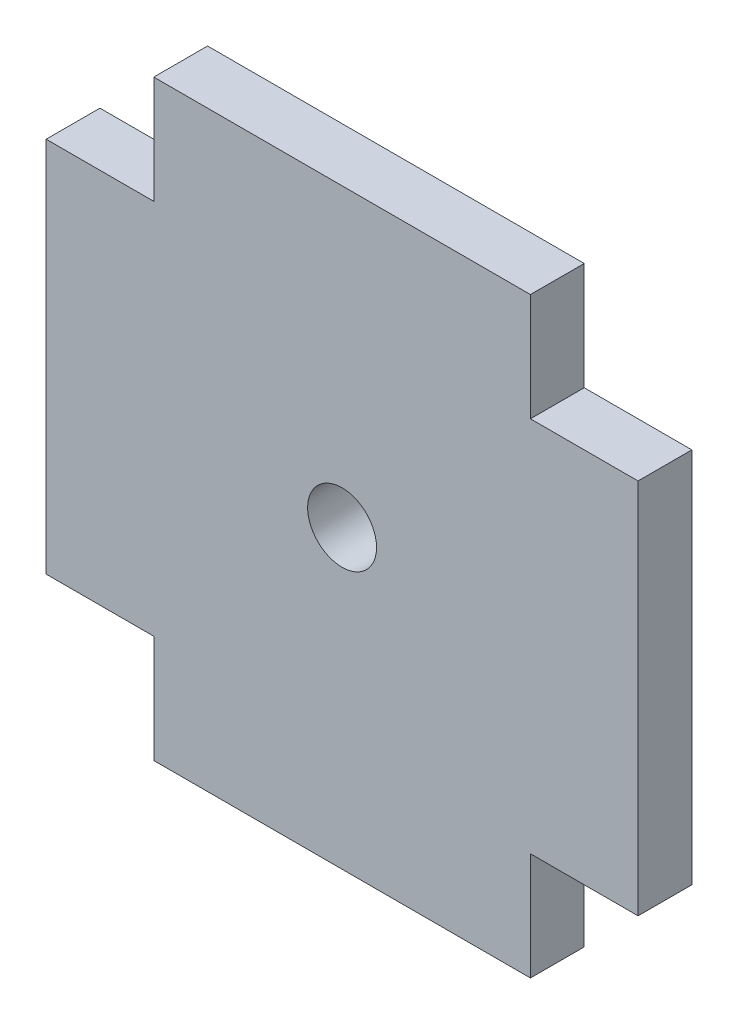
ISO-10303-21;
HEADER;
FILE_DESCRIPTION(('STEP AP214'),'2;1');
FILE_NAME('part.step','',(''),(''),'','','');
FILE_SCHEMA(('AUTOMOTIVE_DESIGN { 1 0 10303 214 1 1 1 1 }'));
ENDSEC;
DATA;
#1=APPLICATION_CONTEXT('core data for automotive mechanical design processes');
#2=APPLICATION_PROTOCOL_DEFINITION('international standard','automotive_design',2000,#1);
#3=PRODUCT_CONTEXT('',#1,'mechanical');
#4=PRODUCT('Part','Part','',(#3));
#5=PRODUCT_RELATED_PRODUCT_CATEGORY('part','',(#4));
#6=PRODUCT_DEFINITION_FORMATION('','',#4);
#7=PRODUCT_DEFINITION_CONTEXT('part definition',#1,'design');
#8=PRODUCT_DEFINITION('design','',#6,#7);
#9=PRODUCT_DEFINITION_SHAPE('','',#8);
#10=(LENGTH_UNIT() NAMED_UNIT(*) SI_UNIT(.MILLI.,.METRE.));
#11=(NAMED_UNIT(*) PLANE_ANGLE_UNIT() SI_UNIT($,.RADIAN.));
#12=(NAMED_UNIT(*) SI_UNIT($,.STERADIAN.) SOLID_ANGLE_UNIT());
#13=UNCERTAINTY_MEASURE_WITH_UNIT(LENGTH_MEASURE(1.E-05),#10,'distance_accuracy_value','');
#14=(GEOMETRIC_REPRESENTATION_CONTEXT(3) GLOBAL_UNCERTAINTY_ASSIGNED_CONTEXT((#13)) GLOBAL_UNIT_ASSIGNED_CONTEXT((#10,
#11,#12)) REPRESENTATION_CONTEXT('',''));
#15=CARTESIAN_POINT('',(0.,0.,0.));
#16=DIRECTION('',(0.,0.,1.));
#17=DIRECTION('',(1.,0.,0.));
#18=AXIS2_PLACEMENT_3D('',#15,#16,#17);
#19=CARTESIAN_POINT('',(-17.5,17.5,-5.));
#20=DIRECTION('',(-1.,0.,0.));
#21=DIRECTION('',(0.,0.,1.));
#22=AXIS2_PLACEMENT_3D('',#19,#20,#21);
#23=PLANE('',#22);
#24=DIRECTION('',(0.,-1.,0.));
#25=VECTOR('',#24,1.);
#26=CARTESIAN_POINT('',(-17.5,17.5,0.));
#27=LINE('',#26,#25);
#28=CARTESIAN_POINT('',(-17.5,27.5,0.));
#29=VERTEX_POINT('',#28);
#30=CARTESIAN_POINT('',(-17.5,17.5,0.));
#31=VERTEX_POINT('',#30);
#32=EDGE_CURVE('E154',#29,#31,#27,.T.);
#33=ORIENTED_EDGE('',*,*,#32,.F.);
#34=DIRECTION('',(0.,0.,1.));
#35=VECTOR('',#34,1.);
#36=CARTESIAN_POINT('',(-17.5,27.5,-5.));
#37=LINE('',#36,#35);
#38=CARTESIAN_POINT('',(-17.5,27.5,-5.));
#39=VERTEX_POINT('',#38);
#40=EDGE_CURVE('E11',#39,#29,#37,.T.);
#41=ORIENTED_EDGE('',*,*,#40,.F.);
#42=DIRECTION('',(0.,-1.,0.));
#43=VECTOR('',#42,1.);
#44=CARTESIAN_POINT('',(-17.5,17.5,-5.));
#45=LINE('',#44,#43);
#46=CARTESIAN_POINT('',(-17.5,17.5,-5.));
#47=VERTEX_POINT('',#46);
#48=EDGE_CURVE('E187',#39,#47,#45,.T.);
#49=ORIENTED_EDGE('',*,*,#48,.T.);
#50=DIRECTION('',(0.,0.,1.));
#51=VECTOR('',#50,1.);
#52=CARTESIAN_POINT('',(-17.5,17.5,-5.));
#53=LINE('',#52,#51);
#54=EDGE_CURVE('E36',#47,#31,#53,.T.);
#55=ORIENTED_EDGE('',*,*,#54,.T.);
#56=EDGE_LOOP('',(#33,#41,#49,#55));
#57=FACE_BOUND('',#56,.T.);
#58=ADVANCED_FACE('F33',(#57),#23,.T.);
#59=CARTESIAN_POINT('',(-17.5,27.5,-5.));
#60=DIRECTION('',(0.,1.,0.));
#61=DIRECTION('',(0.,0.,1.));
#62=AXIS2_PLACEMENT_3D('',#59,#60,#61);
#63=PLANE('',#62);
#64=DIRECTION('',(-1.,0.,0.));
#65=VECTOR('',#64,1.);
#66=CARTESIAN_POINT('',(-17.5,27.5,0.));
#67=LINE('',#66,#65);
#68=CARTESIAN_POINT('',(17.5,27.5,0.));
#69=VERTEX_POINT('',#68);
#70=EDGE_CURVE('E185',#69,#29,#67,.T.);
#71=ORIENTED_EDGE('',*,*,#70,.F.);
#72=DIRECTION('',(0.,0.,1.));
#73=VECTOR('',#72,1.);
#74=CARTESIAN_POINT('',(17.5,27.5,-5.));
#75=LINE('',#74,#73);
#76=CARTESIAN_POINT('',(17.5,27.5,-5.));
#77=VERTEX_POINT('',#76);
#78=EDGE_CURVE('E42',#77,#69,#75,.T.);
#79=ORIENTED_EDGE('',*,*,#78,.F.);
#80=DIRECTION('',(-1.,0.,0.));
#81=VECTOR('',#80,1.);
#82=CARTESIAN_POINT('',(-17.5,27.5,-5.));
#83=LINE('',#82,#81);
#84=EDGE_CURVE('E144',#77,#39,#83,.T.);
#85=ORIENTED_EDGE('',*,*,#84,.T.);
#86=ORIENTED_EDGE('',*,*,#40,.T.);
#87=EDGE_LOOP('',(#71,#79,#85,#86));
#88=FACE_BOUND('',#87,.T.);
#89=ADVANCED_FACE('F207',(#88),#63,.T.);
#90=CARTESIAN_POINT('',(17.5,27.5,-5.));
#91=DIRECTION('',(1.,0.,0.));
#92=DIRECTION('',(0.,0.,-1.));
#93=AXIS2_PLACEMENT_3D('',#90,#91,#92);
#94=PLANE('',#93);
#95=DIRECTION('',(0.,1.,0.));
#96=VECTOR('',#95,1.);
#97=CARTESIAN_POINT('',(17.5,27.5,0.));
#98=LINE('',#97,#96);
#99=CARTESIAN_POINT('',(17.5,17.5,0.));
#100=VERTEX_POINT('',#99);
#101=EDGE_CURVE('E131',#100,#69,#98,.T.);
#102=ORIENTED_EDGE('',*,*,#101,.F.);
#103=DIRECTION('',(0.,0.,1.));
#104=VECTOR('',#103,1.);
#105=CARTESIAN_POINT('',(17.5,17.5,-5.));
#106=LINE('',#105,#104);
#107=CARTESIAN_POINT('',(17.5,17.5,-5.));
#108=VERTEX_POINT('',#107);
#109=EDGE_CURVE('E126',#108,#100,#106,.T.);
#110=ORIENTED_EDGE('',*,*,#109,.F.);
#111=DIRECTION('',(0.,1.,0.));
#112=VECTOR('',#111,1.);
#113=CARTESIAN_POINT('',(17.5,27.5,-5.));
#114=LINE('',#113,#112);
#115=EDGE_CURVE('E129',#108,#77,#114,.T.);
#116=ORIENTED_EDGE('',*,*,#115,.T.);
#117=ORIENTED_EDGE('',*,*,#78,.T.);
#118=EDGE_LOOP('',(#102,#110,#116,#117));
#119=FACE_BOUND('',#118,.T.);
#120=ADVANCED_FACE('F128',(#119),#94,.T.);
#121=CARTESIAN_POINT('',(17.5,17.5,-5.));
#122=DIRECTION('',(0.,1.,0.));
#123=DIRECTION('',(0.,0.,1.));
#124=AXIS2_PLACEMENT_3D('',#121,#122,#123);
#125=PLANE('',#124);
#126=DIRECTION('',(-1.,0.,0.));
#127=VECTOR('',#126,1.);
#128=CARTESIAN_POINT('',(17.5,17.5,0.));
#129=LINE('',#128,#127);
#130=CARTESIAN_POINT('',(27.5,17.5,0.));
#131=VERTEX_POINT('',#130);
#132=EDGE_CURVE('E182',#131,#100,#129,.T.);
#133=ORIENTED_EDGE('',*,*,#132,.F.);
#134=DIRECTION('',(0.,0.,1.));
#135=VECTOR('',#134,1.);
#136=CARTESIAN_POINT('',(27.5,17.5,-5.));
#137=LINE('',#136,#135);
#138=CARTESIAN_POINT('',(27.5,17.5,-5.));
#139=VERTEX_POINT('',#138);
#140=EDGE_CURVE('E136',#139,#131,#137,.T.);
#141=ORIENTED_EDGE('',*,*,#140,.F.);
#142=DIRECTION('',(-1.,0.,0.));
#143=VECTOR('',#142,1.);
#144=CARTESIAN_POINT('',(17.5,17.5,-5.));
#145=LINE('',#144,#143);
#146=EDGE_CURVE('E142',#139,#108,#145,.T.);
#147=ORIENTED_EDGE('',*,*,#146,.T.);
#148=ORIENTED_EDGE('',*,*,#109,.T.);
#149=EDGE_LOOP('',(#133,#141,#147,#148));
#150=FACE_BOUND('',#149,.T.);
#151=ADVANCED_FACE('F146',(#150),#125,.T.);
#152=CARTESIAN_POINT('',(27.5,17.5,-5.));
#153=DIRECTION('',(1.,0.,0.));
#154=DIRECTION('',(0.,1.,0.));
#155=AXIS2_PLACEMENT_3D('',#152,#153,#154);
#156=PLANE('',#155);
#157=DIRECTION('',(0.,1.,0.));
#158=VECTOR('',#157,1.);
#159=CARTESIAN_POINT('',(27.5,17.5,0.));
#160=LINE('',#159,#158);
#161=CARTESIAN_POINT('',(27.5,-17.5,0.));
#162=VERTEX_POINT('',#161);
#163=EDGE_CURVE('E179',#162,#131,#160,.T.);
#164=ORIENTED_EDGE('',*,*,#163,.F.);
#165=DIRECTION('',(0.,0.,1.));
#166=VECTOR('',#165,1.);
#167=CARTESIAN_POINT('',(27.5,-17.5,-5.));
#168=LINE('',#167,#166);
#169=CARTESIAN_POINT('',(27.5,-17.5,-5.));
#170=VERTEX_POINT('',#169);
#171=EDGE_CURVE('E191',#170,#162,#168,.T.);
#172=ORIENTED_EDGE('',*,*,#171,.F.);
#173=DIRECTION('',(0.,1.,0.));
#174=VECTOR('',#173,1.);
#175=CARTESIAN_POINT('',(27.5,17.5,-5.));
#176=LINE('',#175,#174);
#177=EDGE_CURVE('E147',#170,#139,#176,.T.);
#178=ORIENTED_EDGE('',*,*,#177,.T.);
#179=ORIENTED_EDGE('',*,*,#140,.T.);
#180=EDGE_LOOP('',(#164,#172,#178,#179));
#181=FACE_BOUND('',#180,.T.);
#182=ADVANCED_FACE('F220',(#181),#156,.T.);
#183=CARTESIAN_POINT('',(27.5,-17.5,-5.));
#184=DIRECTION('',(0.,-1.,0.));
#185=DIRECTION('',(0.,0.,-1.));
#186=AXIS2_PLACEMENT_3D('',#183,#184,#185);
#187=PLANE('',#186);
#188=DIRECTION('',(1.,0.,0.));
#189=VECTOR('',#188,1.);
#190=CARTESIAN_POINT('',(27.5,-17.5,0.));
#191=LINE('',#190,#189);
#192=CARTESIAN_POINT('',(17.5,-17.5,0.));
#193=VERTEX_POINT('',#192);
#194=EDGE_CURVE('E176',#193,#162,#191,.T.);
#195=ORIENTED_EDGE('',*,*,#194,.F.);
#196=DIRECTION('',(0.,0.,1.));
#197=VECTOR('',#196,1.);
#198=CARTESIAN_POINT('',(17.5,-17.5,-5.));
#199=LINE('',#198,#197);
#200=CARTESIAN_POINT('',(17.5,-17.5,-5.));
#201=VERTEX_POINT('',#200);
#202=EDGE_CURVE('E193',#201,#193,#199,.T.);
#203=ORIENTED_EDGE('',*,*,#202,.F.);
#204=DIRECTION('',(1.,0.,0.));
#205=VECTOR('',#204,1.);
#206=CARTESIAN_POINT('',(27.5,-17.5,-5.));
#207=LINE('',#206,#205);
#208=EDGE_CURVE('E149',#201,#170,#207,.T.);
#209=ORIENTED_EDGE('',*,*,#208,.T.);
#210=ORIENTED_EDGE('',*,*,#171,.T.);
#211=EDGE_LOOP('',(#195,#203,#209,#210));
#212=FACE_BOUND('',#211,.T.);
#213=ADVANCED_FACE('F223',(#212),#187,.T.);
#214=CARTESIAN_POINT('',(17.5,-17.5,-5.));
#215=DIRECTION('',(1.,0.,0.));
#216=DIRECTION('',(0.,0.,-1.));
#217=AXIS2_PLACEMENT_3D('',#214,#215,#216);
#218=PLANE('',#217);
#219=DIRECTION('',(0.,1.,0.));
#220=VECTOR('',#219,1.);
#221=CARTESIAN_POINT('',(17.5,-17.5,0.));
#222=LINE('',#221,#220);
#223=CARTESIAN_POINT('',(17.5,-27.5,0.));
#224=VERTEX_POINT('',#223);
#225=EDGE_CURVE('E173',#224,#193,#222,.T.);
#226=ORIENTED_EDGE('',*,*,#225,.F.);
#227=DIRECTION('',(0.,0.,1.));
#228=VECTOR('',#227,1.);
#229=CARTESIAN_POINT('',(17.5,-27.5,-5.));
#230=LINE('',#229,#228);
#231=CARTESIAN_POINT('',(17.5,-27.5,-5.));
#232=VERTEX_POINT('',#231);
#233=EDGE_CURVE('E195',#232,#224,#230,.T.);
#234=ORIENTED_EDGE('',*,*,#233,.F.);
#235=DIRECTION('',(0.,1.,0.));
#236=VECTOR('',#235,1.);
#237=CARTESIAN_POINT('',(17.5,-17.5,-5.));
#238=LINE('',#237,#236);
#239=EDGE_CURVE('E286',#232,#201,#238,.T.);
#240=ORIENTED_EDGE('',*,*,#239,.T.);
#241=ORIENTED_EDGE('',*,*,#202,.T.);
#242=EDGE_LOOP('',(#226,#234,#240,#241));
#243=FACE_BOUND('',#242,.T.);
#244=ADVANCED_FACE('F227',(#243),#218,.T.);
#245=CARTESIAN_POINT('',(-17.5,-27.5,-5.));
#246=DIRECTION('',(0.,-1.,0.));
#247=DIRECTION('',(0.,0.,-1.));
#248=AXIS2_PLACEMENT_3D('',#245,#246,#247);
#249=PLANE('',#248);
#250=DIRECTION('',(1.,0.,0.));
#251=VECTOR('',#250,1.);
#252=CARTESIAN_POINT('',(-17.5,-27.5,0.));
#253=LINE('',#252,#251);
#254=CARTESIAN_POINT('',(-17.5,-27.5,0.));
#255=VERTEX_POINT('',#254);
#256=EDGE_CURVE('E170',#255,#224,#253,.T.);
#257=ORIENTED_EDGE('',*,*,#256,.F.);
#258=DIRECTION('',(0.,0.,1.));
#259=VECTOR('',#258,1.);
#260=CARTESIAN_POINT('',(-17.5,-27.5,-5.));
#261=LINE('',#260,#259);
#262=CARTESIAN_POINT('',(-17.5,-27.5,-5.));
#263=VERTEX_POINT('',#262);
#264=EDGE_CURVE('E197',#263,#255,#261,.T.);
#265=ORIENTED_EDGE('',*,*,#264,.F.);
#266=DIRECTION('',(1.,0.,0.));
#267=VECTOR('',#266,1.);
#268=CARTESIAN_POINT('',(-17.5,-27.5,-5.));
#269=LINE('',#268,#267);
#270=EDGE_CURVE('E283',#263,#232,#269,.T.);
#271=ORIENTED_EDGE('',*,*,#270,.T.);
#272=ORIENTED_EDGE('',*,*,#233,.T.);
#273=EDGE_LOOP('',(#257,#265,#271,#272));
#274=FACE_BOUND('',#273,.T.);
#275=ADVANCED_FACE('F231',(#274),#249,.T.);
#276=CARTESIAN_POINT('',(-17.5,-27.5,-5.));
#277=DIRECTION('',(-1.,0.,0.));
#278=DIRECTION('',(0.,0.,1.));
#279=AXIS2_PLACEMENT_3D('',#276,#277,#278);
#280=PLANE('',#279);
#281=DIRECTION('',(0.,-1.,0.));
#282=VECTOR('',#281,1.);
#283=CARTESIAN_POINT('',(-17.5,-27.5,0.));
#284=LINE('',#283,#282);
#285=CARTESIAN_POINT('',(-17.5,-17.5,0.));
#286=VERTEX_POINT('',#285);
#287=EDGE_CURVE('E167',#286,#255,#284,.T.);
#288=ORIENTED_EDGE('',*,*,#287,.F.);
#289=DIRECTION('',(0.,0.,1.));
#290=VECTOR('',#289,1.);
#291=CARTESIAN_POINT('',(-17.5,-17.5,-5.));
#292=LINE('',#291,#290);
#293=CARTESIAN_POINT('',(-17.5,-17.5,-5.));
#294=VERTEX_POINT('',#293);
#295=EDGE_CURVE('E199',#294,#286,#292,.T.);
#296=ORIENTED_EDGE('',*,*,#295,.F.);
#297=DIRECTION('',(0.,-1.,0.));
#298=VECTOR('',#297,1.);
#299=CARTESIAN_POINT('',(-17.5,-27.5,-5.));
#300=LINE('',#299,#298);
#301=EDGE_CURVE('E280',#294,#263,#300,.T.);
#302=ORIENTED_EDGE('',*,*,#301,.T.);
#303=ORIENTED_EDGE('',*,*,#264,.T.);
#304=EDGE_LOOP('',(#288,#296,#302,#303));
#305=FACE_BOUND('',#304,.T.);
#306=ADVANCED_FACE('F235',(#305),#280,.T.);
#307=CARTESIAN_POINT('',(-17.5,-17.5,-5.));
#308=DIRECTION('',(0.,-1.,0.));
#309=DIRECTION('',(0.,0.,-1.));
#310=AXIS2_PLACEMENT_3D('',#307,#308,#309);
#311=PLANE('',#310);
#312=DIRECTION('',(1.,0.,0.));
#313=VECTOR('',#312,1.);
#314=CARTESIAN_POINT('',(-17.5,-17.5,0.));
#315=LINE('',#314,#313);
#316=CARTESIAN_POINT('',(-27.5,-17.5,0.));
#317=VERTEX_POINT('',#316);
#318=EDGE_CURVE('E164',#317,#286,#315,.T.);
#319=ORIENTED_EDGE('',*,*,#318,.F.);
#320=DIRECTION('',(0.,0.,1.));
#321=VECTOR('',#320,1.);
#322=CARTESIAN_POINT('',(-27.5,-17.5,-5.));
#323=LINE('',#322,#321);
#324=CARTESIAN_POINT('',(-27.5,-17.5,-5.));
#325=VERTEX_POINT('',#324);
#326=EDGE_CURVE('E201',#325,#317,#323,.T.);
#327=ORIENTED_EDGE('',*,*,#326,.F.);
#328=DIRECTION('',(1.,0.,0.));
#329=VECTOR('',#328,1.);
#330=CARTESIAN_POINT('',(-17.5,-17.5,-5.));
#331=LINE('',#330,#329);
#332=EDGE_CURVE('E277',#325,#294,#331,.T.);
#333=ORIENTED_EDGE('',*,*,#332,.T.);
#334=ORIENTED_EDGE('',*,*,#295,.T.);
#335=EDGE_LOOP('',(#319,#327,#333,#334));
#336=FACE_BOUND('',#335,.T.);
#337=ADVANCED_FACE('F239',(#336),#311,.T.);
#338=CARTESIAN_POINT('',(-27.5,17.5,-5.));
#339=DIRECTION('',(-1.,0.,0.));
#340=DIRECTION('',(0.,-1.,0.));
#341=AXIS2_PLACEMENT_3D('',#338,#339,#340);
#342=PLANE('',#341);
#343=DIRECTION('',(0.,-1.,0.));
#344=VECTOR('',#343,1.);
#345=CARTESIAN_POINT('',(-27.5,17.5,0.));
#346=LINE('',#345,#344);
#347=CARTESIAN_POINT('',(-27.5,17.5,0.));
#348=VERTEX_POINT('',#347);
#349=EDGE_CURVE('E161',#348,#317,#346,.T.);
#350=ORIENTED_EDGE('',*,*,#349,.F.);
#351=DIRECTION('',(0.,0.,1.));
#352=VECTOR('',#351,1.);
#353=CARTESIAN_POINT('',(-27.5,17.5,-5.));
#354=LINE('',#353,#352);
#355=CARTESIAN_POINT('',(-27.5,17.5,-5.));
#356=VERTEX_POINT('',#355);
#357=EDGE_CURVE('E202',#356,#348,#354,.T.);
#358=ORIENTED_EDGE('',*,*,#357,.F.);
#359=DIRECTION('',(0.,-1.,0.));
#360=VECTOR('',#359,1.);
#361=CARTESIAN_POINT('',(-27.5,17.5,-5.));
#362=LINE('',#361,#360);
#363=EDGE_CURVE('E274',#356,#325,#362,.T.);
#364=ORIENTED_EDGE('',*,*,#363,.T.);
#365=ORIENTED_EDGE('',*,*,#326,.T.);
#366=EDGE_LOOP('',(#350,#358,#364,#365));
#367=FACE_BOUND('',#366,.T.);
#368=ADVANCED_FACE('F243',(#367),#342,.T.);
#369=CARTESIAN_POINT('',(-27.5,17.5,-5.));
#370=DIRECTION('',(0.,1.,0.));
#371=DIRECTION('',(0.,0.,1.));
#372=AXIS2_PLACEMENT_3D('',#369,#370,#371);
#373=PLANE('',#372);
#374=DIRECTION('',(-1.,0.,0.));
#375=VECTOR('',#374,1.);
#376=CARTESIAN_POINT('',(-27.5,17.5,0.));
#377=LINE('',#376,#375);
#378=EDGE_CURVE('E157',#31,#348,#377,.T.);
#379=ORIENTED_EDGE('',*,*,#378,.F.);
#380=ORIENTED_EDGE('',*,*,#54,.F.);
#381=DIRECTION('',(-1.,0.,0.));
#382=VECTOR('',#381,1.);
#383=CARTESIAN_POINT('',(-27.5,17.5,-5.));
#384=LINE('',#383,#382);
#385=EDGE_CURVE('E272',#47,#356,#384,.T.);
#386=ORIENTED_EDGE('',*,*,#385,.T.);
#387=ORIENTED_EDGE('',*,*,#357,.T.);
#388=EDGE_LOOP('',(#379,#380,#386,#387));
#389=FACE_BOUND('',#388,.T.);
#390=ADVANCED_FACE('F204',(#389),#373,.T.);
#391=CARTESIAN_POINT('',(0.,0.,-5.));
#392=DIRECTION('',(0.,0.,-1.));
#393=DIRECTION('',(-1.,0.,0.));
#394=AXIS2_PLACEMENT_3D('',#391,#392,#393);
#395=PLANE('',#394);
#396=CARTESIAN_POINT('',(0.,0.,-5.));
#397=DIRECTION('',(0.,0.,1.));
#398=DIRECTION('',(1.,0.,0.));
#399=AXIS2_PLACEMENT_3D('',#396,#397,#398);
#400=CIRCLE('',#399,3.2);
#401=CARTESIAN_POINT('',(3.2,0.,-5.));
#402=VERTEX_POINT('',#401);
#403=EDGE_CURVE('E158',#402,#402,#400,.T.);
#404=ORIENTED_EDGE('',*,*,#403,.T.);
#405=EDGE_LOOP('',(#404));
#406=FACE_BOUND('',#405,.T.);
#407=ORIENTED_EDGE('',*,*,#48,.F.);
#408=ORIENTED_EDGE('',*,*,#84,.F.);
#409=ORIENTED_EDGE('',*,*,#115,.F.);
#410=ORIENTED_EDGE('',*,*,#146,.F.);
#411=ORIENTED_EDGE('',*,*,#177,.F.);
#412=ORIENTED_EDGE('',*,*,#208,.F.);
#413=ORIENTED_EDGE('',*,*,#239,.F.);
#414=ORIENTED_EDGE('',*,*,#270,.F.);
#415=ORIENTED_EDGE('',*,*,#301,.F.);
#416=ORIENTED_EDGE('',*,*,#332,.F.);
#417=ORIENTED_EDGE('',*,*,#363,.F.);
#418=ORIENTED_EDGE('',*,*,#385,.F.);
#419=EDGE_LOOP('',(#407,#408,#409,#410,#411,#412,#413,#414,#415,#416,#417,#418));
#420=FACE_BOUND('',#419,.T.);
#421=ADVANCED_FACE('F140',(#406,#420),#395,.T.);
#422=CARTESIAN_POINT('',(0.,0.,0.));
#423=DIRECTION('',(0.,0.,-1.));
#424=DIRECTION('',(-1.,0.,0.));
#425=AXIS2_PLACEMENT_3D('',#422,#423,#424);
#426=PLANE('',#425);
#427=CARTESIAN_POINT('',(0.,0.,0.));
#428=DIRECTION('',(0.,0.,1.));
#429=DIRECTION('',(1.,0.,0.));
#430=AXIS2_PLACEMENT_3D('',#427,#428,#429);
#431=CIRCLE('',#430,3.2);
#432=CARTESIAN_POINT('',(3.2,0.,0.));
#433=VERTEX_POINT('',#432);
#434=EDGE_CURVE('E267',#433,#433,#431,.T.);
#435=ORIENTED_EDGE('',*,*,#434,.F.);
#436=EDGE_LOOP('',(#435));
#437=FACE_BOUND('',#436,.T.);
#438=ORIENTED_EDGE('',*,*,#32,.T.);
#439=ORIENTED_EDGE('',*,*,#378,.T.);
#440=ORIENTED_EDGE('',*,*,#349,.T.);
#441=ORIENTED_EDGE('',*,*,#318,.T.);
#442=ORIENTED_EDGE('',*,*,#287,.T.);
#443=ORIENTED_EDGE('',*,*,#256,.T.);
#444=ORIENTED_EDGE('',*,*,#225,.T.);
#445=ORIENTED_EDGE('',*,*,#194,.T.);
#446=ORIENTED_EDGE('',*,*,#163,.T.);
#447=ORIENTED_EDGE('',*,*,#132,.T.);
#448=ORIENTED_EDGE('',*,*,#101,.T.);
#449=ORIENTED_EDGE('',*,*,#70,.T.);
#450=EDGE_LOOP('',(#438,#439,#440,#441,#442,#443,#444,#445,#446,#447,#448,#449));
#451=FACE_BOUND('',#450,.T.);
#452=ADVANCED_FACE('F206',(#437,#451),#426,.F.);
#453=CARTESIAN_POINT('',(0.,0.,-5.));
#454=DIRECTION('',(0.,0.,1.));
#455=DIRECTION('',(1.,0.,0.));
#456=AXIS2_PLACEMENT_3D('',#453,#454,#455);
#457=CYLINDRICAL_SURFACE('',#456,3.2);
#458=ORIENTED_EDGE('',*,*,#403,.F.);
#459=EDGE_LOOP('',(#458));
#460=FACE_BOUND('',#459,.T.);
#461=ORIENTED_EDGE('',*,*,#434,.T.);
#462=EDGE_LOOP('',(#461));
#463=FACE_BOUND('',#462,.T.);
#464=ADVANCED_FACE('F255',(#460,#463),#457,.F.);
#465=CLOSED_SHELL('',(#58,#89,#120,#151,#182,#213,#244,#275,#306,#337,#368,#390,#421,#452,#464));
#466=MANIFOLD_SOLID_BREP('B2',#465);
#467=ADVANCED_BREP_SHAPE_REPRESENTATION('',(#18,#466),#14);
#468=SHAPE_DEFINITION_REPRESENTATION(#9,#467);
ENDSEC;
END-ISO-10303-21;
